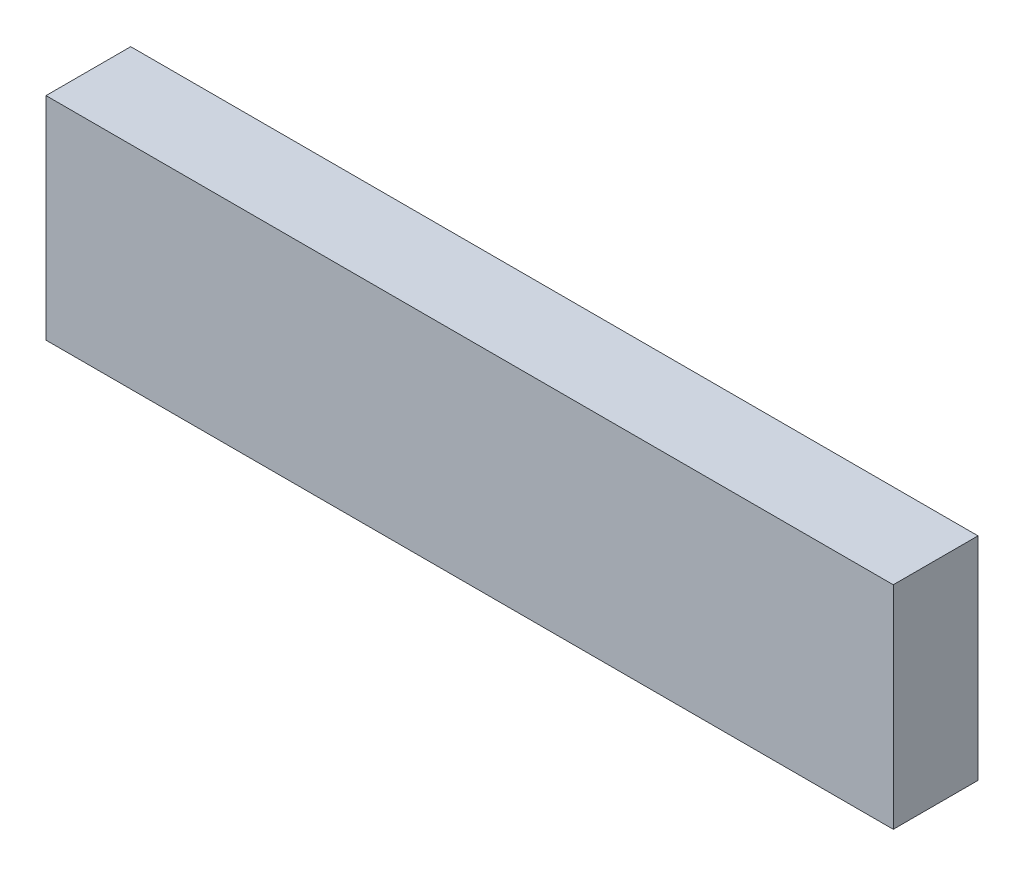
ISO-10303-21;
HEADER;
FILE_DESCRIPTION(('STEP AP214'),'2;1');
FILE_NAME('part.step','',(''),(''),'','','');
FILE_SCHEMA(('AUTOMOTIVE_DESIGN { 1 0 10303 214 1 1 1 1 }'));
ENDSEC;
DATA;
#1=APPLICATION_CONTEXT('core data for automotive mechanical design processes');
#2=APPLICATION_PROTOCOL_DEFINITION('international standard','automotive_design',2000,#1);
#3=PRODUCT_CONTEXT('',#1,'mechanical');
#4=PRODUCT('Part','Part','',(#3));
#5=PRODUCT_RELATED_PRODUCT_CATEGORY('part','',(#4));
#6=PRODUCT_DEFINITION_FORMATION('','',#4);
#7=PRODUCT_DEFINITION_CONTEXT('part definition',#1,'design');
#8=PRODUCT_DEFINITION('design','',#6,#7);
#9=PRODUCT_DEFINITION_SHAPE('','',#8);
#10=(LENGTH_UNIT() NAMED_UNIT(*) SI_UNIT(.MILLI.,.METRE.));
#11=(NAMED_UNIT(*) PLANE_ANGLE_UNIT() SI_UNIT($,.RADIAN.));
#12=(NAMED_UNIT(*) SI_UNIT($,.STERADIAN.) SOLID_ANGLE_UNIT());
#13=UNCERTAINTY_MEASURE_WITH_UNIT(LENGTH_MEASURE(1.E-05),#10,'distance_accuracy_value','');
#14=(GEOMETRIC_REPRESENTATION_CONTEXT(3) GLOBAL_UNCERTAINTY_ASSIGNED_CONTEXT((#13)) GLOBAL_UNIT_ASSIGNED_CONTEXT((#10,
#11,#12)) REPRESENTATION_CONTEXT('',''));
#15=CARTESIAN_POINT('',(0.,0.,0.));
#16=DIRECTION('',(0.,0.,1.));
#17=DIRECTION('',(1.,0.,0.));
#18=AXIS2_PLACEMENT_3D('',#15,#16,#17);
#19=CARTESIAN_POINT('',(500.,-250.,50.));
#20=DIRECTION('',(1.,0.,0.));
#21=DIRECTION('',(0.,0.,-1.));
#22=AXIS2_PLACEMENT_3D('',#19,#20,#21);
#23=PLANE('',#22);
#24=DIRECTION('',(0.,0.,-1.));
#25=VECTOR('',#24,1.);
#26=CARTESIAN_POINT('',(500.,0.,50.));
#27=LINE('',#26,#25);
#28=CARTESIAN_POINT('',(500.,0.,50.));
#29=VERTEX_POINT('',#28);
#30=CARTESIAN_POINT('',(500.,0.,-50.));
#31=VERTEX_POINT('',#30);
#32=EDGE_CURVE('E97',#29,#31,#27,.T.);
#33=ORIENTED_EDGE('',*,*,#32,.F.);
#34=DIRECTION('',(0.,1.,0.));
#35=VECTOR('',#34,1.);
#36=CARTESIAN_POINT('',(500.,-250.,50.));
#37=LINE('',#36,#35);
#38=CARTESIAN_POINT('',(500.,-250.,50.));
#39=VERTEX_POINT('',#38);
#40=EDGE_CURVE('E11',#39,#29,#37,.T.);
#41=ORIENTED_EDGE('',*,*,#40,.F.);
#42=DIRECTION('',(0.,0.,-1.));
#43=VECTOR('',#42,1.);
#44=CARTESIAN_POINT('',(500.,-250.,50.));
#45=LINE('',#44,#43);
#46=CARTESIAN_POINT('',(500.,-250.,-50.));
#47=VERTEX_POINT('',#46);
#48=EDGE_CURVE('E91',#39,#47,#45,.T.);
#49=ORIENTED_EDGE('',*,*,#48,.T.);
#50=DIRECTION('',(0.,1.,0.));
#51=VECTOR('',#50,1.);
#52=CARTESIAN_POINT('',(500.,-250.,-50.));
#53=LINE('',#52,#51);
#54=EDGE_CURVE('E36',#47,#31,#53,.T.);
#55=ORIENTED_EDGE('',*,*,#54,.T.);
#56=EDGE_LOOP('',(#33,#41,#49,#55));
#57=FACE_BOUND('',#56,.T.);
#58=ADVANCED_FACE('F33',(#57),#23,.T.);
#59=CARTESIAN_POINT('',(-500.,-250.,50.));
#60=DIRECTION('',(0.,0.,1.));
#61=DIRECTION('',(1.,0.,0.));
#62=AXIS2_PLACEMENT_3D('',#59,#60,#61);
#63=PLANE('',#62);
#64=DIRECTION('',(1.,0.,0.));
#65=VECTOR('',#64,1.);
#66=CARTESIAN_POINT('',(-500.,0.,50.));
#67=LINE('',#66,#65);
#68=CARTESIAN_POINT('',(-500.,0.,50.));
#69=VERTEX_POINT('',#68);
#70=EDGE_CURVE('E93',#69,#29,#67,.T.);
#71=ORIENTED_EDGE('',*,*,#70,.F.);
#72=DIRECTION('',(0.,1.,0.));
#73=VECTOR('',#72,1.);
#74=CARTESIAN_POINT('',(-500.,-250.,50.));
#75=LINE('',#74,#73);
#76=CARTESIAN_POINT('',(-500.,-250.,50.));
#77=VERTEX_POINT('',#76);
#78=EDGE_CURVE('E42',#77,#69,#75,.T.);
#79=ORIENTED_EDGE('',*,*,#78,.F.);
#80=DIRECTION('',(1.,0.,0.));
#81=VECTOR('',#80,1.);
#82=CARTESIAN_POINT('',(-500.,-250.,50.));
#83=LINE('',#82,#81);
#84=EDGE_CURVE('E88',#77,#39,#83,.T.);
#85=ORIENTED_EDGE('',*,*,#84,.T.);
#86=ORIENTED_EDGE('',*,*,#40,.T.);
#87=EDGE_LOOP('',(#71,#79,#85,#86));
#88=FACE_BOUND('',#87,.T.);
#89=ADVANCED_FACE('F107',(#88),#63,.T.);
#90=CARTESIAN_POINT('',(-500.,-250.,50.));
#91=DIRECTION('',(-1.,0.,0.));
#92=DIRECTION('',(0.,0.,1.));
#93=AXIS2_PLACEMENT_3D('',#90,#91,#92);
#94=PLANE('',#93);
#95=DIRECTION('',(0.,0.,1.));
#96=VECTOR('',#95,1.);
#97=CARTESIAN_POINT('',(-500.,0.,50.));
#98=LINE('',#97,#96);
#99=CARTESIAN_POINT('',(-500.,0.,-50.));
#100=VERTEX_POINT('',#99);
#101=EDGE_CURVE('E83',#100,#69,#98,.T.);
#102=ORIENTED_EDGE('',*,*,#101,.F.);
#103=DIRECTION('',(0.,1.,0.));
#104=VECTOR('',#103,1.);
#105=CARTESIAN_POINT('',(-500.,-250.,-50.));
#106=LINE('',#105,#104);
#107=CARTESIAN_POINT('',(-500.,-250.,-50.));
#108=VERTEX_POINT('',#107);
#109=EDGE_CURVE('E78',#108,#100,#106,.T.);
#110=ORIENTED_EDGE('',*,*,#109,.F.);
#111=DIRECTION('',(0.,0.,1.));
#112=VECTOR('',#111,1.);
#113=CARTESIAN_POINT('',(-500.,-250.,50.));
#114=LINE('',#113,#112);
#115=EDGE_CURVE('E81',#108,#77,#114,.T.);
#116=ORIENTED_EDGE('',*,*,#115,.T.);
#117=ORIENTED_EDGE('',*,*,#78,.T.);
#118=EDGE_LOOP('',(#102,#110,#116,#117));
#119=FACE_BOUND('',#118,.T.);
#120=ADVANCED_FACE('F80',(#119),#94,.T.);
#121=CARTESIAN_POINT('',(-500.,-250.,-50.));
#122=DIRECTION('',(0.,0.,-1.));
#123=DIRECTION('',(-1.,0.,0.));
#124=AXIS2_PLACEMENT_3D('',#121,#122,#123);
#125=PLANE('',#124);
#126=DIRECTION('',(-1.,0.,0.));
#127=VECTOR('',#126,1.);
#128=CARTESIAN_POINT('',(-500.,0.,-50.));
#129=LINE('',#128,#127);
#130=EDGE_CURVE('E100',#31,#100,#129,.T.);
#131=ORIENTED_EDGE('',*,*,#130,.F.);
#132=ORIENTED_EDGE('',*,*,#54,.F.);
#133=DIRECTION('',(-1.,0.,0.));
#134=VECTOR('',#133,1.);
#135=CARTESIAN_POINT('',(-500.,-250.,-50.));
#136=LINE('',#135,#134);
#137=EDGE_CURVE('E87',#47,#108,#136,.T.);
#138=ORIENTED_EDGE('',*,*,#137,.T.);
#139=ORIENTED_EDGE('',*,*,#109,.T.);
#140=EDGE_LOOP('',(#131,#132,#138,#139));
#141=FACE_BOUND('',#140,.T.);
#142=ADVANCED_FACE('F90',(#141),#125,.T.);
#143=CARTESIAN_POINT('',(0.,-250.,0.));
#144=DIRECTION('',(0.,-1.,0.));
#145=DIRECTION('',(0.,0.,-1.));
#146=AXIS2_PLACEMENT_3D('',#143,#144,#145);
#147=PLANE('',#146);
#148=ORIENTED_EDGE('',*,*,#48,.F.);
#149=ORIENTED_EDGE('',*,*,#84,.F.);
#150=ORIENTED_EDGE('',*,*,#115,.F.);
#151=ORIENTED_EDGE('',*,*,#137,.F.);
#152=EDGE_LOOP('',(#148,#149,#150,#151));
#153=FACE_BOUND('',#152,.T.);
#154=ADVANCED_FACE('F86',(#153),#147,.T.);
#155=CARTESIAN_POINT('',(0.,0.,0.));
#156=DIRECTION('',(0.,-1.,0.));
#157=DIRECTION('',(0.,0.,-1.));
#158=AXIS2_PLACEMENT_3D('',#155,#156,#157);
#159=PLANE('',#158);
#160=ORIENTED_EDGE('',*,*,#32,.T.);
#161=ORIENTED_EDGE('',*,*,#130,.T.);
#162=ORIENTED_EDGE('',*,*,#101,.T.);
#163=ORIENTED_EDGE('',*,*,#70,.T.);
#164=EDGE_LOOP('',(#160,#161,#162,#163));
#165=FACE_BOUND('',#164,.T.);
#166=ADVANCED_FACE('F106',(#165),#159,.F.);
#167=CLOSED_SHELL('',(#58,#89,#120,#142,#154,#166));
#168=MANIFOLD_SOLID_BREP('B2',#167);
#169=ADVANCED_BREP_SHAPE_REPRESENTATION('',(#18,#168),#14);
#170=SHAPE_DEFINITION_REPRESENTATION(#9,#169);
ENDSEC;
END-ISO-10303-21;
